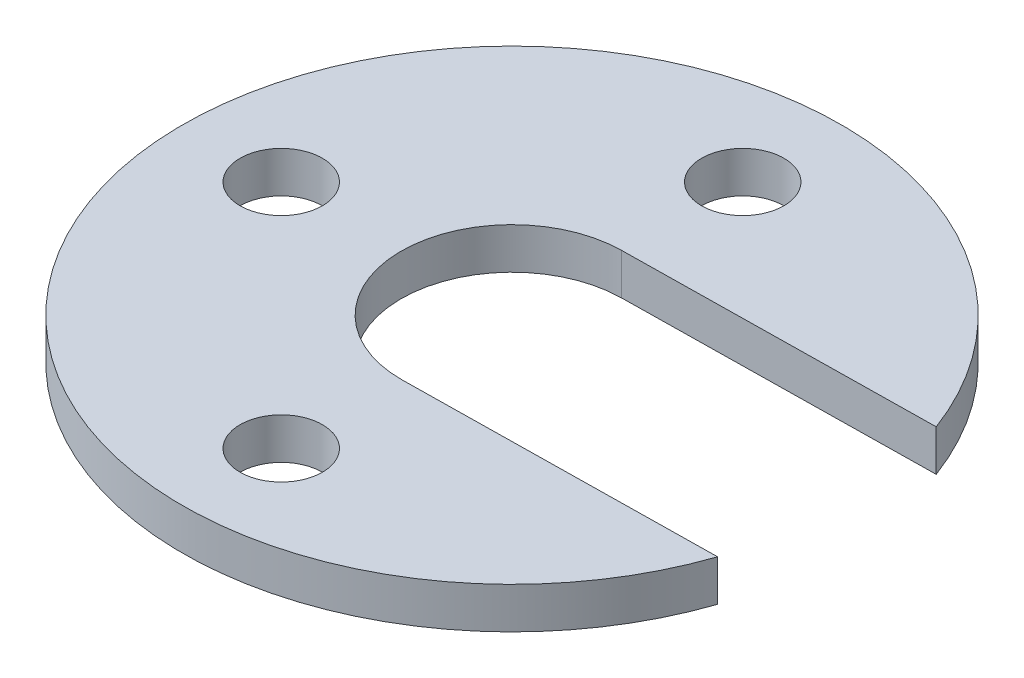
ISO-10303-21;
HEADER;
FILE_DESCRIPTION(('STEP AP214'),'2;1');
FILE_NAME('part.step','',(''),(''),'','','');
FILE_SCHEMA(('AUTOMOTIVE_DESIGN { 1 0 10303 214 1 1 1 1 }'));
ENDSEC;
DATA;
#1=APPLICATION_CONTEXT('core data for automotive mechanical design processes');
#2=APPLICATION_PROTOCOL_DEFINITION('international standard','automotive_design',2000,#1);
#3=PRODUCT_CONTEXT('',#1,'mechanical');
#4=PRODUCT('Part','Part','',(#3));
#5=PRODUCT_RELATED_PRODUCT_CATEGORY('part','',(#4));
#6=PRODUCT_DEFINITION_FORMATION('','',#4);
#7=PRODUCT_DEFINITION_CONTEXT('part definition',#1,'design');
#8=PRODUCT_DEFINITION('design','',#6,#7);
#9=PRODUCT_DEFINITION_SHAPE('','',#8);
#10=(LENGTH_UNIT() NAMED_UNIT(*) SI_UNIT(.MILLI.,.METRE.));
#11=(NAMED_UNIT(*) PLANE_ANGLE_UNIT() SI_UNIT($,.RADIAN.));
#12=(NAMED_UNIT(*) SI_UNIT($,.STERADIAN.) SOLID_ANGLE_UNIT());
#13=UNCERTAINTY_MEASURE_WITH_UNIT(LENGTH_MEASURE(1.E-05),#10,'distance_accuracy_value','');
#14=(GEOMETRIC_REPRESENTATION_CONTEXT(3) GLOBAL_UNCERTAINTY_ASSIGNED_CONTEXT((#13)) GLOBAL_UNIT_ASSIGNED_CONTEXT((#10,
#11,#12)) REPRESENTATION_CONTEXT('',''));
#15=CARTESIAN_POINT('',(0.,0.,0.));
#16=DIRECTION('',(0.,0.,1.));
#17=DIRECTION('',(1.,0.,0.));
#18=AXIS2_PLACEMENT_3D('',#15,#16,#17);
#19=CARTESIAN_POINT('',(-0.197255310900393,5.,-13.4626749689518));
#20=DIRECTION('',(-0.0146504421467148,0.,-0.999892676513288));
#21=DIRECTION('',(-0.999892676513288,0.,0.0146504421467148));
#22=AXIS2_PLACEMENT_3D('',#19,#20,#21);
#23=PLANE('',#22);
#24=DIRECTION('',(0.999892676513288,0.,-0.0146504421467148));
#25=VECTOR('',#24,1.);
#26=CARTESIAN_POINT('',(-0.197255310900393,0.,-13.4626749689518));
#27=LINE('',#26,#25);
#28=CARTESIAN_POINT('',(-0.197255310900393,0.,-13.4626749689518));
#29=VERTEX_POINT('',#28);
#30=CARTESIAN_POINT('',(37.4645684095756,0.,-14.0144965619258));
#31=VERTEX_POINT('',#30);
#32=EDGE_CURVE('E122',#29,#31,#27,.T.);
#33=ORIENTED_EDGE('',*,*,#32,.T.);
#34=DIRECTION('',(0.,-1.,0.));
#35=VECTOR('',#34,1.);
#36=CARTESIAN_POINT('',(37.4645684095756,5.,-14.0144965619258));
#37=LINE('',#36,#35);
#38=CARTESIAN_POINT('',(37.4645684095756,5.,-14.0144965619258));
#39=VERTEX_POINT('',#38);
#40=EDGE_CURVE('E11',#39,#31,#37,.T.);
#41=ORIENTED_EDGE('',*,*,#40,.F.);
#42=DIRECTION('',(0.999892676513288,0.,-0.0146504421467148));
#43=VECTOR('',#42,1.);
#44=CARTESIAN_POINT('',(-0.197255310900393,5.,-13.4626749689518));
#45=LINE('',#44,#43);
#46=CARTESIAN_POINT('',(-0.197255310900393,5.,-13.4626749689518));
#47=VERTEX_POINT('',#46);
#48=EDGE_CURVE('E92',#47,#39,#45,.T.);
#49=ORIENTED_EDGE('',*,*,#48,.F.);
#50=DIRECTION('',(0.,-1.,0.));
#51=VECTOR('',#50,1.);
#52=CARTESIAN_POINT('',(-0.197255310900393,5.,-13.4626749689518));
#53=LINE('',#52,#51);
#54=EDGE_CURVE('E59',#47,#29,#53,.T.);
#55=ORIENTED_EDGE('',*,*,#54,.T.);
#56=EDGE_LOOP('',(#33,#41,#49,#55));
#57=FACE_BOUND('',#56,.T.);
#58=ADVANCED_FACE('F41',(#57),#23,.F.);
#59=CARTESIAN_POINT('',(0.,5.,0.));
#60=DIRECTION('',(0.,-1.,0.));
#61=DIRECTION('',(0.,0.,-1.));
#62=AXIS2_PLACEMENT_3D('',#59,#60,#61);
#63=CYLINDRICAL_SURFACE('',#62,40.);
#64=CARTESIAN_POINT('',(0.,0.,0.));
#65=DIRECTION('',(0.,1.,0.));
#66=DIRECTION('',(0.,0.,1.));
#67=AXIS2_PLACEMENT_3D('',#64,#65,#66);
#68=CIRCLE('',#67,40.);
#69=CARTESIAN_POINT('',(37.8590790313764,0.,12.9108533759778));
#70=VERTEX_POINT('',#69);
#71=EDGE_CURVE('E98',#31,#70,#68,.T.);
#72=ORIENTED_EDGE('',*,*,#71,.T.);
#73=DIRECTION('',(0.,-1.,0.));
#74=VECTOR('',#73,1.);
#75=CARTESIAN_POINT('',(37.8590790313764,5.,12.9108533759778));
#76=LINE('',#75,#74);
#77=CARTESIAN_POINT('',(37.8590790313764,5.,12.9108533759778));
#78=VERTEX_POINT('',#77);
#79=EDGE_CURVE('E51',#78,#70,#76,.T.);
#80=ORIENTED_EDGE('',*,*,#79,.F.);
#81=CARTESIAN_POINT('',(0.,5.,0.));
#82=DIRECTION('',(0.,1.,0.));
#83=DIRECTION('',(0.,0.,1.));
#84=AXIS2_PLACEMENT_3D('',#81,#82,#83);
#85=CIRCLE('',#84,40.);
#86=EDGE_CURVE('E84',#39,#78,#85,.T.);
#87=ORIENTED_EDGE('',*,*,#86,.F.);
#88=ORIENTED_EDGE('',*,*,#40,.T.);
#89=EDGE_LOOP('',(#72,#80,#87,#88));
#90=FACE_BOUND('',#89,.T.);
#91=ADVANCED_FACE('F97',(#90),#63,.T.);
#92=CARTESIAN_POINT('',(0.197255310900394,5.,13.4626749689518));
#93=DIRECTION('',(-0.0146504421467149,0.,-0.999892676513288));
#94=DIRECTION('',(-0.999892676513288,0.,0.0146504421467149));
#95=AXIS2_PLACEMENT_3D('',#92,#93,#94);
#96=PLANE('',#95);
#97=DIRECTION('',(0.999892676513288,0.,-0.0146504421467149));
#98=VECTOR('',#97,1.);
#99=CARTESIAN_POINT('',(0.197255310900394,0.,13.4626749689518));
#100=LINE('',#99,#98);
#101=CARTESIAN_POINT('',(0.197255310900393,0.,13.4626749689518));
#102=VERTEX_POINT('',#101);
#103=EDGE_CURVE('E127',#102,#70,#100,.T.);
#104=ORIENTED_EDGE('',*,*,#103,.F.);
#105=DIRECTION('',(0.,-1.,0.));
#106=VECTOR('',#105,1.);
#107=CARTESIAN_POINT('',(0.197255310900393,5.,13.4626749689518));
#108=LINE('',#107,#106);
#109=CARTESIAN_POINT('',(0.197255310900393,5.,13.4626749689518));
#110=VERTEX_POINT('',#109);
#111=EDGE_CURVE('E73',#110,#102,#108,.T.);
#112=ORIENTED_EDGE('',*,*,#111,.F.);
#113=DIRECTION('',(0.999892676513288,0.,-0.0146504421467149));
#114=VECTOR('',#113,1.);
#115=CARTESIAN_POINT('',(0.197255310900394,5.,13.4626749689518));
#116=LINE('',#115,#114);
#117=EDGE_CURVE('E91',#110,#78,#116,.T.);
#118=ORIENTED_EDGE('',*,*,#117,.T.);
#119=ORIENTED_EDGE('',*,*,#79,.T.);
#120=EDGE_LOOP('',(#104,#112,#118,#119));
#121=FACE_BOUND('',#120,.T.);
#122=ADVANCED_FACE('F102',(#121),#96,.T.);
#123=CARTESIAN_POINT('',(0.,5.,28.));
#124=DIRECTION('',(0.,-1.,0.));
#125=DIRECTION('',(0.,0.,-1.));
#126=AXIS2_PLACEMENT_3D('',#123,#124,#125);
#127=CYLINDRICAL_SURFACE('',#126,5.);
#128=CARTESIAN_POINT('',(0.,5.,28.));
#129=DIRECTION('',(0.,1.,0.));
#130=DIRECTION('',(0.,0.,1.));
#131=AXIS2_PLACEMENT_3D('',#128,#129,#130);
#132=CIRCLE('',#131,5.);
#133=CARTESIAN_POINT('',(0.,5.,33.));
#134=VERTEX_POINT('',#133);
#135=EDGE_CURVE('E147',#134,#134,#132,.T.);
#136=ORIENTED_EDGE('',*,*,#135,.T.);
#137=EDGE_LOOP('',(#136));
#138=FACE_BOUND('',#137,.T.);
#139=CARTESIAN_POINT('',(0.,0.,28.));
#140=DIRECTION('',(0.,1.,0.));
#141=DIRECTION('',(0.,0.,1.));
#142=AXIS2_PLACEMENT_3D('',#139,#140,#141);
#143=CIRCLE('',#142,5.);
#144=CARTESIAN_POINT('',(0.,0.,33.));
#145=VERTEX_POINT('',#144);
#146=EDGE_CURVE('E118',#145,#145,#143,.T.);
#147=ORIENTED_EDGE('',*,*,#146,.F.);
#148=EDGE_LOOP('',(#147));
#149=FACE_BOUND('',#148,.T.);
#150=ADVANCED_FACE('F155',(#138,#149),#127,.F.);
#151=CARTESIAN_POINT('',(-28.,5.,0.));
#152=DIRECTION('',(0.,-1.,0.));
#153=DIRECTION('',(0.,0.,-1.));
#154=AXIS2_PLACEMENT_3D('',#151,#152,#153);
#155=CYLINDRICAL_SURFACE('',#154,5.);
#156=CARTESIAN_POINT('',(-28.,5.,0.));
#157=DIRECTION('',(0.,1.,0.));
#158=DIRECTION('',(0.,0.,1.));
#159=AXIS2_PLACEMENT_3D('',#156,#157,#158);
#160=CIRCLE('',#159,5.);
#161=CARTESIAN_POINT('',(-28.,5.,5.));
#162=VERTEX_POINT('',#161);
#163=EDGE_CURVE('E141',#162,#162,#160,.T.);
#164=ORIENTED_EDGE('',*,*,#163,.T.);
#165=EDGE_LOOP('',(#164));
#166=FACE_BOUND('',#165,.T.);
#167=CARTESIAN_POINT('',(-28.,0.,0.));
#168=DIRECTION('',(0.,1.,0.));
#169=DIRECTION('',(0.,0.,1.));
#170=AXIS2_PLACEMENT_3D('',#167,#168,#169);
#171=CIRCLE('',#170,5.);
#172=CARTESIAN_POINT('',(-28.,0.,5.));
#173=VERTEX_POINT('',#172);
#174=EDGE_CURVE('E114',#173,#173,#171,.T.);
#175=ORIENTED_EDGE('',*,*,#174,.F.);
#176=EDGE_LOOP('',(#175));
#177=FACE_BOUND('',#176,.T.);
#178=ADVANCED_FACE('F180',(#166,#177),#155,.F.);
#179=CARTESIAN_POINT('',(0.,5.,-28.));
#180=DIRECTION('',(0.,-1.,0.));
#181=DIRECTION('',(0.,0.,-1.));
#182=AXIS2_PLACEMENT_3D('',#179,#180,#181);
#183=CYLINDRICAL_SURFACE('',#182,5.);
#184=CARTESIAN_POINT('',(0.,5.,-28.));
#185=DIRECTION('',(0.,1.,0.));
#186=DIRECTION('',(0.,0.,1.));
#187=AXIS2_PLACEMENT_3D('',#184,#185,#186);
#188=CIRCLE('',#187,5.);
#189=CARTESIAN_POINT('',(0.,5.,-23.));
#190=VERTEX_POINT('',#189);
#191=EDGE_CURVE('E134',#190,#190,#188,.T.);
#192=ORIENTED_EDGE('',*,*,#191,.T.);
#193=EDGE_LOOP('',(#192));
#194=FACE_BOUND('',#193,.T.);
#195=CARTESIAN_POINT('',(0.,0.,-28.));
#196=DIRECTION('',(0.,1.,0.));
#197=DIRECTION('',(0.,0.,1.));
#198=AXIS2_PLACEMENT_3D('',#195,#196,#197);
#199=CIRCLE('',#198,5.);
#200=CARTESIAN_POINT('',(0.,0.,-23.));
#201=VERTEX_POINT('',#200);
#202=EDGE_CURVE('E110',#201,#201,#199,.T.);
#203=ORIENTED_EDGE('',*,*,#202,.F.);
#204=EDGE_LOOP('',(#203));
#205=FACE_BOUND('',#204,.T.);
#206=ADVANCED_FACE('F43',(#194,#205),#183,.F.);
#207=CARTESIAN_POINT('',(0.,5.,0.));
#208=DIRECTION('',(0.,-1.,0.));
#209=DIRECTION('',(0.,0.,-1.));
#210=AXIS2_PLACEMENT_3D('',#207,#208,#209);
#211=CYLINDRICAL_SURFACE('',#210,13.4641199852541);
#212=CARTESIAN_POINT('',(0.,0.,0.));
#213=DIRECTION('',(0.,1.,0.));
#214=DIRECTION('',(0.,0.,1.));
#215=AXIS2_PLACEMENT_3D('',#212,#213,#214);
#216=CIRCLE('',#215,13.4641199852541);
#217=EDGE_CURVE('E130',#29,#102,#216,.T.);
#218=ORIENTED_EDGE('',*,*,#217,.F.);
#219=ORIENTED_EDGE('',*,*,#54,.F.);
#220=CARTESIAN_POINT('',(0.,5.,0.));
#221=DIRECTION('',(0.,1.,0.));
#222=DIRECTION('',(0.,0.,1.));
#223=AXIS2_PLACEMENT_3D('',#220,#221,#222);
#224=CIRCLE('',#223,13.4641199852541);
#225=EDGE_CURVE('E104',#47,#110,#224,.T.);
#226=ORIENTED_EDGE('',*,*,#225,.T.);
#227=ORIENTED_EDGE('',*,*,#111,.T.);
#228=EDGE_LOOP('',(#218,#219,#226,#227));
#229=FACE_BOUND('',#228,.T.);
#230=ADVANCED_FACE('F160',(#229),#211,.F.);
#231=CARTESIAN_POINT('',(0.,5.,0.));
#232=DIRECTION('',(0.,1.,0.));
#233=DIRECTION('',(0.,0.,1.));
#234=AXIS2_PLACEMENT_3D('',#231,#232,#233);
#235=PLANE('',#234);
#236=ORIENTED_EDGE('',*,*,#191,.F.);
#237=EDGE_LOOP('',(#236));
#238=FACE_BOUND('',#237,.T.);
#239=ORIENTED_EDGE('',*,*,#163,.F.);
#240=EDGE_LOOP('',(#239));
#241=FACE_BOUND('',#240,.T.);
#242=ORIENTED_EDGE('',*,*,#135,.F.);
#243=EDGE_LOOP('',(#242));
#244=FACE_BOUND('',#243,.T.);
#245=ORIENTED_EDGE('',*,*,#48,.T.);
#246=ORIENTED_EDGE('',*,*,#86,.T.);
#247=ORIENTED_EDGE('',*,*,#117,.F.);
#248=ORIENTED_EDGE('',*,*,#225,.F.);
#249=EDGE_LOOP('',(#245,#246,#247,#248));
#250=FACE_BOUND('',#249,.T.);
#251=ADVANCED_FACE('F88',(#238,#241,#244,#250),#235,.T.);
#252=CARTESIAN_POINT('',(0.,0.,0.));
#253=DIRECTION('',(0.,1.,0.));
#254=DIRECTION('',(0.,0.,1.));
#255=AXIS2_PLACEMENT_3D('',#252,#253,#254);
#256=PLANE('',#255);
#257=ORIENTED_EDGE('',*,*,#202,.T.);
#258=EDGE_LOOP('',(#257));
#259=FACE_BOUND('',#258,.T.);
#260=ORIENTED_EDGE('',*,*,#174,.T.);
#261=EDGE_LOOP('',(#260));
#262=FACE_BOUND('',#261,.T.);
#263=ORIENTED_EDGE('',*,*,#146,.T.);
#264=EDGE_LOOP('',(#263));
#265=FACE_BOUND('',#264,.T.);
#266=ORIENTED_EDGE('',*,*,#32,.F.);
#267=ORIENTED_EDGE('',*,*,#217,.T.);
#268=ORIENTED_EDGE('',*,*,#103,.T.);
#269=ORIENTED_EDGE('',*,*,#71,.F.);
#270=EDGE_LOOP('',(#266,#267,#268,#269));
#271=FACE_BOUND('',#270,.T.);
#272=ADVANCED_FACE('F159',(#259,#262,#265,#271),#256,.F.);
#273=CLOSED_SHELL('',(#58,#91,#122,#150,#178,#206,#230,#251,#272));
#274=MANIFOLD_SOLID_BREP('B2',#273);
#275=ADVANCED_BREP_SHAPE_REPRESENTATION('',(#18,#274),#14);
#276=SHAPE_DEFINITION_REPRESENTATION(#9,#275);
ENDSEC;
END-ISO-10303-21;
